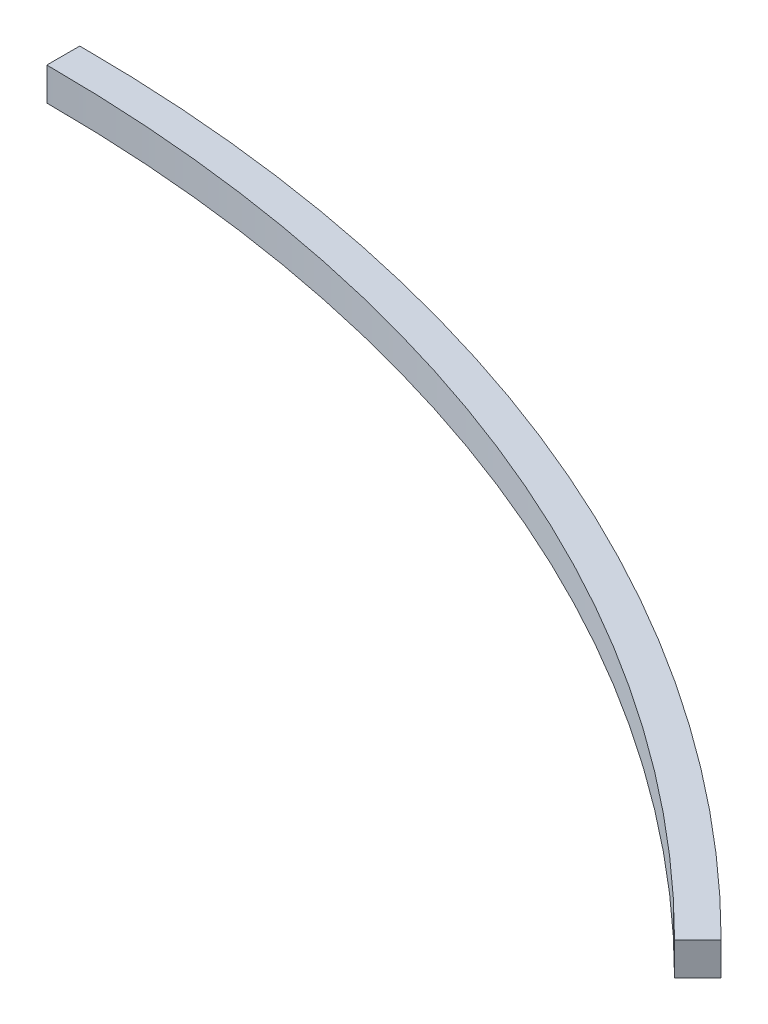
ISO-10303-21;
HEADER;
FILE_DESCRIPTION(('STEP AP214'),'2;1');
FILE_NAME('part.step','',(''),(''),'','','');
FILE_SCHEMA(('AUTOMOTIVE_DESIGN { 1 0 10303 214 1 1 1 1 }'));
ENDSEC;
DATA;
#1=APPLICATION_CONTEXT('core data for automotive mechanical design processes');
#2=APPLICATION_PROTOCOL_DEFINITION('international standard','automotive_design',2000,#1);
#3=PRODUCT_CONTEXT('',#1,'mechanical');
#4=PRODUCT('Part','Part','',(#3));
#5=PRODUCT_RELATED_PRODUCT_CATEGORY('part','',(#4));
#6=PRODUCT_DEFINITION_FORMATION('','',#4);
#7=PRODUCT_DEFINITION_CONTEXT('part definition',#1,'design');
#8=PRODUCT_DEFINITION('design','',#6,#7);
#9=PRODUCT_DEFINITION_SHAPE('','',#8);
#10=(LENGTH_UNIT() NAMED_UNIT(*) SI_UNIT(.MILLI.,.METRE.));
#11=(NAMED_UNIT(*) PLANE_ANGLE_UNIT() SI_UNIT($,.RADIAN.));
#12=(NAMED_UNIT(*) SI_UNIT($,.STERADIAN.) SOLID_ANGLE_UNIT());
#13=UNCERTAINTY_MEASURE_WITH_UNIT(LENGTH_MEASURE(1.E-05),#10,'distance_accuracy_value','');
#14=(GEOMETRIC_REPRESENTATION_CONTEXT(3) GLOBAL_UNCERTAINTY_ASSIGNED_CONTEXT((#13)) GLOBAL_UNIT_ASSIGNED_CONTEXT((#10,
#11,#12)) REPRESENTATION_CONTEXT('',''));
#15=CARTESIAN_POINT('',(0.,0.,0.));
#16=DIRECTION('',(0.,0.,1.));
#17=DIRECTION('',(1.,0.,0.));
#18=AXIS2_PLACEMENT_3D('',#15,#16,#17);
#19=CARTESIAN_POINT('',(0.,10.,0.));
#20=DIRECTION('',(0.,-1.,0.));
#21=DIRECTION('',(0.,0.,-1.));
#22=AXIS2_PLACEMENT_3D('',#19,#20,#21);
#23=CYLINDRICAL_SURFACE('',#22,470.);
#24=CARTESIAN_POINT('',(0.,0.,0.));
#25=DIRECTION('',(0.,1.,0.));
#26=DIRECTION('',(0.,0.,1.));
#27=AXIS2_PLACEMENT_3D('',#24,#25,#26);
#28=CIRCLE('',#27,470.);
#29=CARTESIAN_POINT('',(0.,0.,-470.));
#30=VERTEX_POINT('',#29);
#31=CARTESIAN_POINT('',(332.340187157678,0.,-332.340187157677));
#32=VERTEX_POINT('',#31);
#33=EDGE_CURVE('E99',#30,#32,#28,.F.);
#34=ORIENTED_EDGE('',*,*,#33,.F.);
#35=DIRECTION('',(0.,-1.,0.));
#36=VECTOR('',#35,1.);
#37=CARTESIAN_POINT('',(0.,10.,-470.));
#38=LINE('',#37,#36);
#39=CARTESIAN_POINT('',(0.,10.,-470.));
#40=VERTEX_POINT('',#39);
#41=EDGE_CURVE('E11',#40,#30,#38,.T.);
#42=ORIENTED_EDGE('',*,*,#41,.F.);
#43=CARTESIAN_POINT('',(0.,10.,0.));
#44=DIRECTION('',(0.,1.,0.));
#45=DIRECTION('',(0.,0.,1.));
#46=AXIS2_PLACEMENT_3D('',#43,#44,#45);
#47=CIRCLE('',#46,470.);
#48=CARTESIAN_POINT('',(332.340187157678,10.,-332.340187157677));
#49=VERTEX_POINT('',#48);
#50=EDGE_CURVE('E93',#40,#49,#47,.F.);
#51=ORIENTED_EDGE('',*,*,#50,.T.);
#52=DIRECTION('',(0.,-1.,0.));
#53=VECTOR('',#52,1.);
#54=CARTESIAN_POINT('',(332.340187157678,10.,-332.340187157677));
#55=LINE('',#54,#53);
#56=EDGE_CURVE('E74',#49,#32,#55,.T.);
#57=ORIENTED_EDGE('',*,*,#56,.T.);
#58=EDGE_LOOP('',(#34,#42,#51,#57));
#59=FACE_BOUND('',#58,.T.);
#60=ADVANCED_FACE('F36',(#59),#23,.T.);
#61=CARTESIAN_POINT('',(0.,10.,0.));
#62=DIRECTION('',(-1.,0.,0.));
#63=DIRECTION('',(0.,0.,1.));
#64=AXIS2_PLACEMENT_3D('',#61,#62,#63);
#65=PLANE('',#64);
#66=DIRECTION('',(0.,0.,-1.));
#67=VECTOR('',#66,1.);
#68=CARTESIAN_POINT('',(0.,0.,0.));
#69=LINE('',#68,#67);
#70=CARTESIAN_POINT('',(0.,0.,-460.));
#71=VERTEX_POINT('',#70);
#72=EDGE_CURVE('E87',#71,#30,#69,.T.);
#73=ORIENTED_EDGE('',*,*,#72,.F.);
#74=DIRECTION('',(0.,-1.,0.));
#75=VECTOR('',#74,1.);
#76=CARTESIAN_POINT('',(0.,10.,-460.));
#77=LINE('',#76,#75);
#78=CARTESIAN_POINT('',(0.,10.,-460.));
#79=VERTEX_POINT('',#78);
#80=EDGE_CURVE('E44',#79,#71,#77,.T.);
#81=ORIENTED_EDGE('',*,*,#80,.F.);
#82=DIRECTION('',(0.,0.,-1.));
#83=VECTOR('',#82,1.);
#84=CARTESIAN_POINT('',(0.,10.,0.));
#85=LINE('',#84,#83);
#86=EDGE_CURVE('E85',#79,#40,#85,.T.);
#87=ORIENTED_EDGE('',*,*,#86,.T.);
#88=ORIENTED_EDGE('',*,*,#41,.T.);
#89=EDGE_LOOP('',(#73,#81,#87,#88));
#90=FACE_BOUND('',#89,.T.);
#91=ADVANCED_FACE('F83',(#90),#65,.T.);
#92=CARTESIAN_POINT('',(0.,10.,0.));
#93=DIRECTION('',(0.,-1.,0.));
#94=DIRECTION('',(0.,0.,-1.));
#95=AXIS2_PLACEMENT_3D('',#92,#93,#94);
#96=CYLINDRICAL_SURFACE('',#95,460.);
#97=CARTESIAN_POINT('',(0.,0.,0.));
#98=DIRECTION('',(0.,1.,0.));
#99=DIRECTION('',(0.,0.,1.));
#100=AXIS2_PLACEMENT_3D('',#97,#98,#99);
#101=CIRCLE('',#100,460.);
#102=CARTESIAN_POINT('',(325.269119345812,0.,-325.269119345811));
#103=VERTEX_POINT('',#102);
#104=EDGE_CURVE('E67',#71,#103,#101,.F.);
#105=ORIENTED_EDGE('',*,*,#104,.T.);
#106=DIRECTION('',(0.,-1.,0.));
#107=VECTOR('',#106,1.);
#108=CARTESIAN_POINT('',(325.269119345812,10.,-325.269119345811));
#109=LINE('',#108,#107);
#110=CARTESIAN_POINT('',(325.269119345812,10.,-325.269119345811));
#111=VERTEX_POINT('',#110);
#112=EDGE_CURVE('E88',#111,#103,#109,.T.);
#113=ORIENTED_EDGE('',*,*,#112,.F.);
#114=CARTESIAN_POINT('',(0.,10.,0.));
#115=DIRECTION('',(0.,1.,0.));
#116=DIRECTION('',(0.,0.,1.));
#117=AXIS2_PLACEMENT_3D('',#114,#115,#116);
#118=CIRCLE('',#117,460.);
#119=EDGE_CURVE('E89',#79,#111,#118,.F.);
#120=ORIENTED_EDGE('',*,*,#119,.F.);
#121=ORIENTED_EDGE('',*,*,#80,.T.);
#122=EDGE_LOOP('',(#105,#113,#120,#121));
#123=FACE_BOUND('',#122,.T.);
#124=ADVANCED_FACE('F90',(#123),#96,.F.);
#125=CARTESIAN_POINT('',(5.29906204805774E-13,10.,5.29906204805774E-13));
#126=DIRECTION('',(-0.707106781186548,0.,-0.707106781186548));
#127=DIRECTION('',(-0.707106781186548,0.,0.707106781186548));
#128=AXIS2_PLACEMENT_3D('',#125,#126,#127);
#129=PLANE('',#128);
#130=DIRECTION('',(0.707106781186548,0.,-0.707106781186548));
#131=VECTOR('',#130,1.);
#132=CARTESIAN_POINT('',(5.29906204805774E-13,0.,5.29906204805774E-13));
#133=LINE('',#132,#131);
#134=EDGE_CURVE('E95',#103,#32,#133,.T.);
#135=ORIENTED_EDGE('',*,*,#134,.T.);
#136=ORIENTED_EDGE('',*,*,#56,.F.);
#137=DIRECTION('',(0.707106781186548,0.,-0.707106781186548));
#138=VECTOR('',#137,1.);
#139=CARTESIAN_POINT('',(5.29906204805774E-13,10.,5.29906204805774E-13));
#140=LINE('',#139,#138);
#141=EDGE_CURVE('E52',#111,#49,#140,.T.);
#142=ORIENTED_EDGE('',*,*,#141,.F.);
#143=ORIENTED_EDGE('',*,*,#112,.T.);
#144=EDGE_LOOP('',(#135,#136,#142,#143));
#145=FACE_BOUND('',#144,.T.);
#146=ADVANCED_FACE('F108',(#145),#129,.F.);
#147=CARTESIAN_POINT('',(0.,10.,0.));
#148=DIRECTION('',(0.,1.,0.));
#149=DIRECTION('',(0.,0.,1.));
#150=AXIS2_PLACEMENT_3D('',#147,#148,#149);
#151=PLANE('',#150);
#152=ORIENTED_EDGE('',*,*,#50,.F.);
#153=ORIENTED_EDGE('',*,*,#86,.F.);
#154=ORIENTED_EDGE('',*,*,#119,.T.);
#155=ORIENTED_EDGE('',*,*,#141,.T.);
#156=EDGE_LOOP('',(#152,#153,#154,#155));
#157=FACE_BOUND('',#156,.T.);
#158=ADVANCED_FACE('F92',(#157),#151,.T.);
#159=CARTESIAN_POINT('',(0.,0.,0.));
#160=DIRECTION('',(0.,1.,0.));
#161=DIRECTION('',(0.,0.,1.));
#162=AXIS2_PLACEMENT_3D('',#159,#160,#161);
#163=PLANE('',#162);
#164=ORIENTED_EDGE('',*,*,#33,.T.);
#165=ORIENTED_EDGE('',*,*,#134,.F.);
#166=ORIENTED_EDGE('',*,*,#104,.F.);
#167=ORIENTED_EDGE('',*,*,#72,.T.);
#168=EDGE_LOOP('',(#164,#165,#166,#167));
#169=FACE_BOUND('',#168,.T.);
#170=ADVANCED_FACE('F110',(#169),#163,.F.);
#171=CLOSED_SHELL('',(#60,#91,#124,#146,#158,#170));
#172=MANIFOLD_SOLID_BREP('B2',#171);
#173=ADVANCED_BREP_SHAPE_REPRESENTATION('',(#18,#172),#14);
#174=SHAPE_DEFINITION_REPRESENTATION(#9,#173);
ENDSEC;
END-ISO-10303-21;
